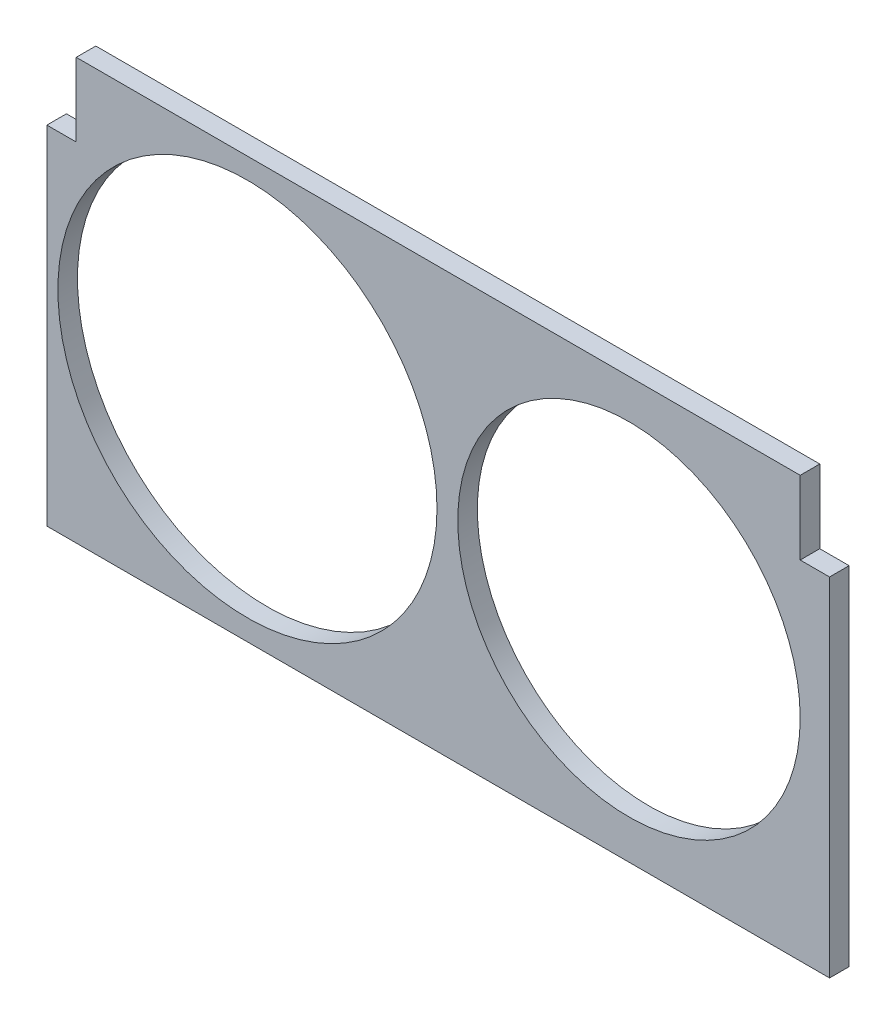
ISO-10303-21;
HEADER;
FILE_DESCRIPTION(('STEP AP214'),'2;1');
FILE_NAME('part.step','',(''),(''),'','','');
FILE_SCHEMA(('AUTOMOTIVE_DESIGN { 1 0 10303 214 1 1 1 1 }'));
ENDSEC;
DATA;
#1=APPLICATION_CONTEXT('core data for automotive mechanical design processes');
#2=APPLICATION_PROTOCOL_DEFINITION('international standard','automotive_design',2000,#1);
#3=PRODUCT_CONTEXT('',#1,'mechanical');
#4=PRODUCT('Part','Part','',(#3));
#5=PRODUCT_RELATED_PRODUCT_CATEGORY('part','',(#4));
#6=PRODUCT_DEFINITION_FORMATION('','',#4);
#7=PRODUCT_DEFINITION_CONTEXT('part definition',#1,'design');
#8=PRODUCT_DEFINITION('design','',#6,#7);
#9=PRODUCT_DEFINITION_SHAPE('','',#8);
#10=(LENGTH_UNIT() NAMED_UNIT(*) SI_UNIT(.MILLI.,.METRE.));
#11=(NAMED_UNIT(*) PLANE_ANGLE_UNIT() SI_UNIT($,.RADIAN.));
#12=(NAMED_UNIT(*) SI_UNIT($,.STERADIAN.) SOLID_ANGLE_UNIT());
#13=UNCERTAINTY_MEASURE_WITH_UNIT(LENGTH_MEASURE(1.E-05),#10,'distance_accuracy_value','');
#14=(GEOMETRIC_REPRESENTATION_CONTEXT(3) GLOBAL_UNCERTAINTY_ASSIGNED_CONTEXT((#13)) GLOBAL_UNIT_ASSIGNED_CONTEXT((#10,
#11,#12)) REPRESENTATION_CONTEXT('',''));
#15=CARTESIAN_POINT('',(0.,0.,0.));
#16=DIRECTION('',(0.,0.,1.));
#17=DIRECTION('',(1.,0.,0.));
#18=AXIS2_PLACEMENT_3D('',#15,#16,#17);
#19=CARTESIAN_POINT('',(0.,0.,8.));
#20=DIRECTION('',(0.,0.,-1.));
#21=DIRECTION('',(-1.,0.,0.));
#22=AXIS2_PLACEMENT_3D('',#19,#20,#21);
#23=PLANE('',#22);
#24=DIRECTION('',(0.,-1.,0.));
#25=VECTOR('',#24,1.);
#26=CARTESIAN_POINT('',(-160.27028303853,-60.3544303797468,8.));
#27=LINE('',#26,#25);
#28=CARTESIAN_POINT('',(-160.27028303853,81.6455696202532,8.));
#29=VERTEX_POINT('',#28);
#30=CARTESIAN_POINT('',(-160.27028303853,-60.3544303797468,8.));
#31=VERTEX_POINT('',#30);
#32=EDGE_CURVE('E144',#29,#31,#27,.T.);
#33=ORIENTED_EDGE('',*,*,#32,.T.);
#34=DIRECTION('',(1.,0.,0.));
#35=VECTOR('',#34,1.);
#36=CARTESIAN_POINT('',(-160.27028303853,-60.3544303797468,8.));
#37=LINE('',#36,#35);
#38=CARTESIAN_POINT('',(159.72971696147,-60.3544303797468,8.));
#39=VERTEX_POINT('',#38);
#40=EDGE_CURVE('E92',#31,#39,#37,.T.);
#41=ORIENTED_EDGE('',*,*,#40,.T.);
#42=DIRECTION('',(0.,1.,0.));
#43=VECTOR('',#42,1.);
#44=CARTESIAN_POINT('',(159.72971696147,-60.3544303797468,8.));
#45=LINE('',#44,#43);
#46=CARTESIAN_POINT('',(159.72971696147,81.6455696202532,8.));
#47=VERTEX_POINT('',#46);
#48=EDGE_CURVE('E159',#39,#47,#45,.T.);
#49=ORIENTED_EDGE('',*,*,#48,.T.);
#50=DIRECTION('',(-1.,0.,0.));
#51=VECTOR('',#50,1.);
#52=CARTESIAN_POINT('',(159.72971696147,81.6455696202532,8.));
#53=LINE('',#52,#51);
#54=CARTESIAN_POINT('',(147.72971696147,81.6455696202532,8.));
#55=VERTEX_POINT('',#54);
#56=EDGE_CURVE('E172',#47,#55,#53,.T.);
#57=ORIENTED_EDGE('',*,*,#56,.T.);
#58=DIRECTION('',(0.,1.,0.));
#59=VECTOR('',#58,1.);
#60=CARTESIAN_POINT('',(147.72971696147,111.645569620253,8.));
#61=LINE('',#60,#59);
#62=CARTESIAN_POINT('',(147.72971696147,111.645569620253,8.));
#63=VERTEX_POINT('',#62);
#64=EDGE_CURVE('E111',#55,#63,#61,.T.);
#65=ORIENTED_EDGE('',*,*,#64,.T.);
#66=DIRECTION('',(-1.,0.,0.));
#67=VECTOR('',#66,1.);
#68=CARTESIAN_POINT('',(-148.27028303853,111.645569620253,8.));
#69=LINE('',#68,#67);
#70=CARTESIAN_POINT('',(-148.27028303853,111.645569620253,8.));
#71=VERTEX_POINT('',#70);
#72=EDGE_CURVE('E105',#63,#71,#69,.T.);
#73=ORIENTED_EDGE('',*,*,#72,.T.);
#74=DIRECTION('',(0.,-1.,0.));
#75=VECTOR('',#74,1.);
#76=CARTESIAN_POINT('',(-148.27028303853,111.645569620253,8.));
#77=LINE('',#76,#75);
#78=CARTESIAN_POINT('',(-148.27028303853,81.6455696202532,8.));
#79=VERTEX_POINT('',#78);
#80=EDGE_CURVE('E109',#71,#79,#77,.T.);
#81=ORIENTED_EDGE('',*,*,#80,.T.);
#82=DIRECTION('',(-1.,0.,0.));
#83=VECTOR('',#82,1.);
#84=CARTESIAN_POINT('',(-160.27028303853,81.6455696202532,8.));
#85=LINE('',#84,#83);
#86=EDGE_CURVE('E49',#79,#29,#85,.T.);
#87=ORIENTED_EDGE('',*,*,#86,.T.);
#88=EDGE_LOOP('',(#33,#41,#49,#57,#65,#73,#81,#87));
#89=FACE_BOUND('',#88,.T.);
#90=CARTESIAN_POINT('',(-78.2702830385304,25.6455696202532,8.));
#91=DIRECTION('',(0.,0.,1.));
#92=DIRECTION('',(1.,0.,0.));
#93=AXIS2_PLACEMENT_3D('',#90,#91,#92);
#94=CIRCLE('',#93,77.5);
#95=CARTESIAN_POINT('',(-0.770283038530398,25.6455696202532,8.));
#96=VERTEX_POINT('',#95);
#97=EDGE_CURVE('E133',#96,#96,#94,.T.);
#98=ORIENTED_EDGE('',*,*,#97,.F.);
#99=EDGE_LOOP('',(#98));
#100=FACE_BOUND('',#99,.T.);
#101=CARTESIAN_POINT('',(77.7297169614696,25.6455696202532,8.));
#102=DIRECTION('',(0.,0.,1.));
#103=DIRECTION('',(1.,0.,0.));
#104=AXIS2_PLACEMENT_3D('',#101,#102,#103);
#105=CIRCLE('',#104,70.);
#106=CARTESIAN_POINT('',(147.72971696147,25.6455696202532,8.));
#107=VERTEX_POINT('',#106);
#108=EDGE_CURVE('E181',#107,#107,#105,.T.);
#109=ORIENTED_EDGE('',*,*,#108,.F.);
#110=EDGE_LOOP('',(#109));
#111=FACE_BOUND('',#110,.T.);
#112=ADVANCED_FACE('F32',(#89,#100,#111),#23,.F.);
#113=CARTESIAN_POINT('',(0.,0.,0.));
#114=DIRECTION('',(0.,0.,-1.));
#115=DIRECTION('',(-1.,0.,0.));
#116=AXIS2_PLACEMENT_3D('',#113,#114,#115);
#117=PLANE('',#116);
#118=CARTESIAN_POINT('',(144.72971696147,-45.3544303797468,0.));
#119=DIRECTION('',(0.,0.,-1.));
#120=DIRECTION('',(-1.,0.,0.));
#121=AXIS2_PLACEMENT_3D('',#118,#119,#120);
#122=CIRCLE('',#121,1.5);
#123=CARTESIAN_POINT('',(143.22971696147,-45.3544303797468,0.));
#124=VERTEX_POINT('',#123);
#125=EDGE_CURVE('E202',#124,#124,#122,.T.);
#126=ORIENTED_EDGE('',*,*,#125,.F.);
#127=EDGE_LOOP('',(#126));
#128=FACE_BOUND('',#127,.T.);
#129=CARTESIAN_POINT('',(-145.27028303853,-45.3544303797468,0.));
#130=DIRECTION('',(0.,0.,-1.));
#131=DIRECTION('',(-1.,0.,0.));
#132=AXIS2_PLACEMENT_3D('',#129,#130,#131);
#133=CIRCLE('',#132,1.5);
#134=CARTESIAN_POINT('',(-146.77028303853,-45.3544303797468,0.));
#135=VERTEX_POINT('',#134);
#136=EDGE_CURVE('E196',#135,#135,#133,.T.);
#137=ORIENTED_EDGE('',*,*,#136,.F.);
#138=EDGE_LOOP('',(#137));
#139=FACE_BOUND('',#138,.T.);
#140=CARTESIAN_POINT('',(-0.270283038530314,96.6455696202532,0.));
#141=DIRECTION('',(0.,0.,-1.));
#142=DIRECTION('',(-1.,0.,0.));
#143=AXIS2_PLACEMENT_3D('',#140,#141,#142);
#144=CIRCLE('',#143,1.5);
#145=CARTESIAN_POINT('',(-1.77028303853031,96.6455696202532,0.));
#146=VERTEX_POINT('',#145);
#147=EDGE_CURVE('E190',#146,#146,#144,.T.);
#148=ORIENTED_EDGE('',*,*,#147,.F.);
#149=EDGE_LOOP('',(#148));
#150=FACE_BOUND('',#149,.T.);
#151=CARTESIAN_POINT('',(-78.2702830385304,25.6455696202532,0.));
#152=DIRECTION('',(0.,0.,1.));
#153=DIRECTION('',(1.,0.,0.));
#154=AXIS2_PLACEMENT_3D('',#151,#152,#153);
#155=CIRCLE('',#154,77.5);
#156=CARTESIAN_POINT('',(-0.770283038530398,25.6455696202532,0.));
#157=VERTEX_POINT('',#156);
#158=EDGE_CURVE('E178',#157,#157,#155,.T.);
#159=ORIENTED_EDGE('',*,*,#158,.T.);
#160=EDGE_LOOP('',(#159));
#161=FACE_BOUND('',#160,.T.);
#162=DIRECTION('',(0.,-1.,0.));
#163=VECTOR('',#162,1.);
#164=CARTESIAN_POINT('',(-160.27028303853,-60.3544303797468,0.));
#165=LINE('',#164,#163);
#166=CARTESIAN_POINT('',(-160.27028303853,81.6455696202532,0.));
#167=VERTEX_POINT('',#166);
#168=CARTESIAN_POINT('',(-160.27028303853,-60.3544303797468,0.));
#169=VERTEX_POINT('',#168);
#170=EDGE_CURVE('E129',#167,#169,#165,.T.);
#171=ORIENTED_EDGE('',*,*,#170,.F.);
#172=DIRECTION('',(-1.,0.,0.));
#173=VECTOR('',#172,1.);
#174=CARTESIAN_POINT('',(-160.27028303853,81.6455696202532,0.));
#175=LINE('',#174,#173);
#176=CARTESIAN_POINT('',(-148.27028303853,81.6455696202532,0.));
#177=VERTEX_POINT('',#176);
#178=EDGE_CURVE('E84',#177,#167,#175,.T.);
#179=ORIENTED_EDGE('',*,*,#178,.F.);
#180=DIRECTION('',(0.,-1.,0.));
#181=VECTOR('',#180,1.);
#182=CARTESIAN_POINT('',(-148.27028303853,111.645569620253,0.));
#183=LINE('',#182,#181);
#184=CARTESIAN_POINT('',(-148.27028303853,111.645569620253,0.));
#185=VERTEX_POINT('',#184);
#186=EDGE_CURVE('E78',#185,#177,#183,.T.);
#187=ORIENTED_EDGE('',*,*,#186,.F.);
#188=DIRECTION('',(-1.,0.,0.));
#189=VECTOR('',#188,1.);
#190=CARTESIAN_POINT('',(-148.27028303853,111.645569620253,0.));
#191=LINE('',#190,#189);
#192=CARTESIAN_POINT('',(147.72971696147,111.645569620253,0.));
#193=VERTEX_POINT('',#192);
#194=EDGE_CURVE('E119',#193,#185,#191,.T.);
#195=ORIENTED_EDGE('',*,*,#194,.F.);
#196=DIRECTION('',(0.,1.,0.));
#197=VECTOR('',#196,1.);
#198=CARTESIAN_POINT('',(147.72971696147,111.645569620253,0.));
#199=LINE('',#198,#197);
#200=CARTESIAN_POINT('',(147.72971696147,81.6455696202532,0.));
#201=VERTEX_POINT('',#200);
#202=EDGE_CURVE('E139',#201,#193,#199,.T.);
#203=ORIENTED_EDGE('',*,*,#202,.F.);
#204=DIRECTION('',(-1.,0.,0.));
#205=VECTOR('',#204,1.);
#206=CARTESIAN_POINT('',(159.72971696147,81.6455696202532,0.));
#207=LINE('',#206,#205);
#208=CARTESIAN_POINT('',(159.72971696147,81.6455696202532,0.));
#209=VERTEX_POINT('',#208);
#210=EDGE_CURVE('E137',#209,#201,#207,.T.);
#211=ORIENTED_EDGE('',*,*,#210,.F.);
#212=DIRECTION('',(0.,1.,0.));
#213=VECTOR('',#212,1.);
#214=CARTESIAN_POINT('',(159.72971696147,-60.3544303797468,0.));
#215=LINE('',#214,#213);
#216=CARTESIAN_POINT('',(159.72971696147,-60.3544303797468,0.));
#217=VERTEX_POINT('',#216);
#218=EDGE_CURVE('E135',#217,#209,#215,.T.);
#219=ORIENTED_EDGE('',*,*,#218,.F.);
#220=DIRECTION('',(1.,0.,0.));
#221=VECTOR('',#220,1.);
#222=CARTESIAN_POINT('',(-160.27028303853,-60.3544303797468,0.));
#223=LINE('',#222,#221);
#224=EDGE_CURVE('E132',#169,#217,#223,.T.);
#225=ORIENTED_EDGE('',*,*,#224,.F.);
#226=EDGE_LOOP('',(#171,#179,#187,#195,#203,#211,#219,#225));
#227=FACE_BOUND('',#226,.T.);
#228=CARTESIAN_POINT('',(77.7297169614696,25.6455696202532,0.));
#229=DIRECTION('',(0.,0.,1.));
#230=DIRECTION('',(1.,0.,0.));
#231=AXIS2_PLACEMENT_3D('',#228,#229,#230);
#232=CIRCLE('',#231,70.);
#233=CARTESIAN_POINT('',(147.72971696147,25.6455696202532,0.));
#234=VERTEX_POINT('',#233);
#235=EDGE_CURVE('E184',#234,#234,#232,.T.);
#236=ORIENTED_EDGE('',*,*,#235,.T.);
#237=EDGE_LOOP('',(#236));
#238=FACE_BOUND('',#237,.T.);
#239=ADVANCED_FACE('F163',(#128,#139,#150,#161,#227,#238),#117,.T.);
#240=CARTESIAN_POINT('',(-160.27028303853,-60.3544303797468,8.));
#241=DIRECTION('',(1.,0.,0.));
#242=DIRECTION('',(0.,1.,0.));
#243=AXIS2_PLACEMENT_3D('',#240,#241,#242);
#244=PLANE('',#243);
#245=ORIENTED_EDGE('',*,*,#170,.T.);
#246=DIRECTION('',(0.,0.,-1.));
#247=VECTOR('',#246,1.);
#248=CARTESIAN_POINT('',(-160.27028303853,-60.3544303797468,8.));
#249=LINE('',#248,#247);
#250=EDGE_CURVE('E11',#31,#169,#249,.T.);
#251=ORIENTED_EDGE('',*,*,#250,.F.);
#252=ORIENTED_EDGE('',*,*,#32,.F.);
#253=DIRECTION('',(0.,0.,-1.));
#254=VECTOR('',#253,1.);
#255=CARTESIAN_POINT('',(-160.27028303853,81.6455696202532,8.));
#256=LINE('',#255,#254);
#257=EDGE_CURVE('E125',#29,#167,#256,.T.);
#258=ORIENTED_EDGE('',*,*,#257,.T.);
#259=EDGE_LOOP('',(#245,#251,#252,#258));
#260=FACE_BOUND('',#259,.T.);
#261=ADVANCED_FACE('F34',(#260),#244,.F.);
#262=CARTESIAN_POINT('',(-160.27028303853,-60.3544303797468,8.));
#263=DIRECTION('',(0.,1.,0.));
#264=DIRECTION('',(0.,0.,1.));
#265=AXIS2_PLACEMENT_3D('',#262,#263,#264);
#266=PLANE('',#265);
#267=ORIENTED_EDGE('',*,*,#224,.T.);
#268=DIRECTION('',(0.,0.,-1.));
#269=VECTOR('',#268,1.);
#270=CARTESIAN_POINT('',(159.72971696147,-60.3544303797468,8.));
#271=LINE('',#270,#269);
#272=EDGE_CURVE('E41',#39,#217,#271,.T.);
#273=ORIENTED_EDGE('',*,*,#272,.F.);
#274=ORIENTED_EDGE('',*,*,#40,.F.);
#275=ORIENTED_EDGE('',*,*,#250,.T.);
#276=EDGE_LOOP('',(#267,#273,#274,#275));
#277=FACE_BOUND('',#276,.T.);
#278=ADVANCED_FACE('F254',(#277),#266,.F.);
#279=CARTESIAN_POINT('',(159.72971696147,-60.3544303797468,8.));
#280=DIRECTION('',(-1.,0.,0.));
#281=DIRECTION('',(0.,-1.,0.));
#282=AXIS2_PLACEMENT_3D('',#279,#280,#281);
#283=PLANE('',#282);
#284=ORIENTED_EDGE('',*,*,#218,.T.);
#285=DIRECTION('',(0.,0.,-1.));
#286=VECTOR('',#285,1.);
#287=CARTESIAN_POINT('',(159.72971696147,81.6455696202532,8.));
#288=LINE('',#287,#286);
#289=EDGE_CURVE('E151',#47,#209,#288,.T.);
#290=ORIENTED_EDGE('',*,*,#289,.F.);
#291=ORIENTED_EDGE('',*,*,#48,.F.);
#292=ORIENTED_EDGE('',*,*,#272,.T.);
#293=EDGE_LOOP('',(#284,#290,#291,#292));
#294=FACE_BOUND('',#293,.T.);
#295=ADVANCED_FACE('F157',(#294),#283,.F.);
#296=CARTESIAN_POINT('',(159.72971696147,81.6455696202532,8.));
#297=DIRECTION('',(0.,-1.,0.));
#298=DIRECTION('',(0.,0.,-1.));
#299=AXIS2_PLACEMENT_3D('',#296,#297,#298);
#300=PLANE('',#299);
#301=ORIENTED_EDGE('',*,*,#210,.T.);
#302=DIRECTION('',(0.,0.,-1.));
#303=VECTOR('',#302,1.);
#304=CARTESIAN_POINT('',(147.72971696147,81.6455696202532,8.));
#305=LINE('',#304,#303);
#306=EDGE_CURVE('E148',#55,#201,#305,.T.);
#307=ORIENTED_EDGE('',*,*,#306,.F.);
#308=ORIENTED_EDGE('',*,*,#56,.F.);
#309=ORIENTED_EDGE('',*,*,#289,.T.);
#310=EDGE_LOOP('',(#301,#307,#308,#309));
#311=FACE_BOUND('',#310,.T.);
#312=ADVANCED_FACE('F168',(#311),#300,.F.);
#313=CARTESIAN_POINT('',(147.72971696147,111.645569620253,8.));
#314=DIRECTION('',(-1.,0.,0.));
#315=DIRECTION('',(0.,-1.,0.));
#316=AXIS2_PLACEMENT_3D('',#313,#314,#315);
#317=PLANE('',#316);
#318=ORIENTED_EDGE('',*,*,#202,.T.);
#319=DIRECTION('',(0.,0.,-1.));
#320=VECTOR('',#319,1.);
#321=CARTESIAN_POINT('',(147.72971696147,111.645569620253,8.));
#322=LINE('',#321,#320);
#323=EDGE_CURVE('E120',#63,#193,#322,.T.);
#324=ORIENTED_EDGE('',*,*,#323,.F.);
#325=ORIENTED_EDGE('',*,*,#64,.F.);
#326=ORIENTED_EDGE('',*,*,#306,.T.);
#327=EDGE_LOOP('',(#318,#324,#325,#326));
#328=FACE_BOUND('',#327,.T.);
#329=ADVANCED_FACE('F171',(#328),#317,.F.);
#330=CARTESIAN_POINT('',(-148.27028303853,111.645569620253,8.));
#331=DIRECTION('',(0.,-1.,0.));
#332=DIRECTION('',(0.,0.,-1.));
#333=AXIS2_PLACEMENT_3D('',#330,#331,#332);
#334=PLANE('',#333);
#335=ORIENTED_EDGE('',*,*,#194,.T.);
#336=DIRECTION('',(0.,0.,-1.));
#337=VECTOR('',#336,1.);
#338=CARTESIAN_POINT('',(-148.27028303853,111.645569620253,8.));
#339=LINE('',#338,#337);
#340=EDGE_CURVE('E116',#71,#185,#339,.T.);
#341=ORIENTED_EDGE('',*,*,#340,.F.);
#342=ORIENTED_EDGE('',*,*,#72,.F.);
#343=ORIENTED_EDGE('',*,*,#323,.T.);
#344=EDGE_LOOP('',(#335,#341,#342,#343));
#345=FACE_BOUND('',#344,.T.);
#346=ADVANCED_FACE('F117',(#345),#334,.F.);
#347=CARTESIAN_POINT('',(-148.27028303853,111.645569620253,8.));
#348=DIRECTION('',(1.,0.,0.));
#349=DIRECTION('',(0.,1.,0.));
#350=AXIS2_PLACEMENT_3D('',#347,#348,#349);
#351=PLANE('',#350);
#352=ORIENTED_EDGE('',*,*,#186,.T.);
#353=DIRECTION('',(0.,0.,-1.));
#354=VECTOR('',#353,1.);
#355=CARTESIAN_POINT('',(-148.27028303853,81.6455696202532,8.));
#356=LINE('',#355,#354);
#357=EDGE_CURVE('E121',#79,#177,#356,.T.);
#358=ORIENTED_EDGE('',*,*,#357,.F.);
#359=ORIENTED_EDGE('',*,*,#80,.F.);
#360=ORIENTED_EDGE('',*,*,#340,.T.);
#361=EDGE_LOOP('',(#352,#358,#359,#360));
#362=FACE_BOUND('',#361,.T.);
#363=ADVANCED_FACE('F123',(#362),#351,.F.);
#364=CARTESIAN_POINT('',(-160.27028303853,81.6455696202532,8.));
#365=DIRECTION('',(0.,-1.,0.));
#366=DIRECTION('',(0.,0.,-1.));
#367=AXIS2_PLACEMENT_3D('',#364,#365,#366);
#368=PLANE('',#367);
#369=ORIENTED_EDGE('',*,*,#178,.T.);
#370=ORIENTED_EDGE('',*,*,#257,.F.);
#371=ORIENTED_EDGE('',*,*,#86,.F.);
#372=ORIENTED_EDGE('',*,*,#357,.T.);
#373=EDGE_LOOP('',(#369,#370,#371,#372));
#374=FACE_BOUND('',#373,.T.);
#375=ADVANCED_FACE('F229',(#374),#368,.F.);
#376=CARTESIAN_POINT('',(-78.2702830385304,25.6455696202532,8.));
#377=DIRECTION('',(0.,0.,-1.));
#378=DIRECTION('',(-1.,0.,0.));
#379=AXIS2_PLACEMENT_3D('',#376,#377,#378);
#380=CYLINDRICAL_SURFACE('',#379,77.5);
#381=ORIENTED_EDGE('',*,*,#97,.T.);
#382=EDGE_LOOP('',(#381));
#383=FACE_BOUND('',#382,.T.);
#384=ORIENTED_EDGE('',*,*,#158,.F.);
#385=EDGE_LOOP('',(#384));
#386=FACE_BOUND('',#385,.T.);
#387=ADVANCED_FACE('F226',(#383,#386),#380,.F.);
#388=CARTESIAN_POINT('',(77.7297169614696,25.6455696202532,8.));
#389=DIRECTION('',(0.,0.,-1.));
#390=DIRECTION('',(-1.,0.,0.));
#391=AXIS2_PLACEMENT_3D('',#388,#389,#390);
#392=CYLINDRICAL_SURFACE('',#391,70.);
#393=ORIENTED_EDGE('',*,*,#108,.T.);
#394=EDGE_LOOP('',(#393));
#395=FACE_BOUND('',#394,.T.);
#396=ORIENTED_EDGE('',*,*,#235,.F.);
#397=EDGE_LOOP('',(#396));
#398=FACE_BOUND('',#397,.T.);
#399=ADVANCED_FACE('F228',(#395,#398),#392,.F.);
#400=CARTESIAN_POINT('',(-0.270283038530314,96.6455696202532,6.));
#401=DIRECTION('',(0.,0.,-1.));
#402=DIRECTION('',(-1.,0.,0.));
#403=AXIS2_PLACEMENT_3D('',#400,#401,#402);
#404=CYLINDRICAL_SURFACE('',#403,1.5);
#405=CARTESIAN_POINT('',(-0.270283038530314,96.6455696202532,6.));
#406=DIRECTION('',(0.,0.,-1.));
#407=DIRECTION('',(-1.,0.,0.));
#408=AXIS2_PLACEMENT_3D('',#405,#406,#407);
#409=CIRCLE('',#408,1.5);
#410=CARTESIAN_POINT('',(-1.77028303853031,96.6455696202532,6.));
#411=VERTEX_POINT('',#410);
#412=EDGE_CURVE('E187',#411,#411,#409,.T.);
#413=ORIENTED_EDGE('',*,*,#412,.F.);
#414=EDGE_LOOP('',(#413));
#415=FACE_BOUND('',#414,.T.);
#416=ORIENTED_EDGE('',*,*,#147,.T.);
#417=EDGE_LOOP('',(#416));
#418=FACE_BOUND('',#417,.T.);
#419=ADVANCED_FACE('F236',(#415,#418),#404,.F.);
#420=CARTESIAN_POINT('',(-0.270283038530314,96.6455696202532,6.));
#421=DIRECTION('',(0.,0.,-1.));
#422=DIRECTION('',(-1.,0.,0.));
#423=AXIS2_PLACEMENT_3D('',#420,#421,#422);
#424=PLANE('',#423);
#425=ORIENTED_EDGE('',*,*,#412,.T.);
#426=EDGE_LOOP('',(#425));
#427=FACE_BOUND('',#426,.T.);
#428=ADVANCED_FACE('F281',(#427),#424,.T.);
#429=CARTESIAN_POINT('',(-145.27028303853,-45.3544303797468,6.));
#430=DIRECTION('',(0.,0.,-1.));
#431=DIRECTION('',(-1.,0.,0.));
#432=AXIS2_PLACEMENT_3D('',#429,#430,#431);
#433=CYLINDRICAL_SURFACE('',#432,1.5);
#434=CARTESIAN_POINT('',(-145.27028303853,-45.3544303797468,6.));
#435=DIRECTION('',(0.,0.,-1.));
#436=DIRECTION('',(-1.,0.,0.));
#437=AXIS2_PLACEMENT_3D('',#434,#435,#436);
#438=CIRCLE('',#437,1.5);
#439=CARTESIAN_POINT('',(-146.77028303853,-45.3544303797468,6.));
#440=VERTEX_POINT('',#439);
#441=EDGE_CURVE('E199',#440,#440,#438,.T.);
#442=ORIENTED_EDGE('',*,*,#441,.F.);
#443=EDGE_LOOP('',(#442));
#444=FACE_BOUND('',#443,.T.);
#445=ORIENTED_EDGE('',*,*,#136,.T.);
#446=EDGE_LOOP('',(#445));
#447=FACE_BOUND('',#446,.T.);
#448=ADVANCED_FACE('F291',(#444,#447),#433,.F.);
#449=CARTESIAN_POINT('',(-145.27028303853,-45.3544303797468,6.));
#450=DIRECTION('',(0.,0.,-1.));
#451=DIRECTION('',(-1.,0.,0.));
#452=AXIS2_PLACEMENT_3D('',#449,#450,#451);
#453=PLANE('',#452);
#454=ORIENTED_EDGE('',*,*,#441,.T.);
#455=EDGE_LOOP('',(#454));
#456=FACE_BOUND('',#455,.T.);
#457=ADVANCED_FACE('F213',(#456),#453,.T.);
#458=CARTESIAN_POINT('',(144.72971696147,-45.3544303797468,6.));
#459=DIRECTION('',(0.,0.,-1.));
#460=DIRECTION('',(-1.,0.,0.));
#461=AXIS2_PLACEMENT_3D('',#458,#459,#460);
#462=CYLINDRICAL_SURFACE('',#461,1.5);
#463=CARTESIAN_POINT('',(144.72971696147,-45.3544303797468,6.));
#464=DIRECTION('',(0.,0.,-1.));
#465=DIRECTION('',(-1.,0.,0.));
#466=AXIS2_PLACEMENT_3D('',#463,#464,#465);
#467=CIRCLE('',#466,1.5);
#468=CARTESIAN_POINT('',(143.22971696147,-45.3544303797468,6.));
#469=VERTEX_POINT('',#468);
#470=EDGE_CURVE('E193',#469,#469,#467,.T.);
#471=ORIENTED_EDGE('',*,*,#470,.F.);
#472=EDGE_LOOP('',(#471));
#473=FACE_BOUND('',#472,.T.);
#474=ORIENTED_EDGE('',*,*,#125,.T.);
#475=EDGE_LOOP('',(#474));
#476=FACE_BOUND('',#475,.T.);
#477=ADVANCED_FACE('F210',(#473,#476),#462,.F.);
#478=CARTESIAN_POINT('',(144.72971696147,-45.3544303797468,6.));
#479=DIRECTION('',(0.,0.,-1.));
#480=DIRECTION('',(-1.,0.,0.));
#481=AXIS2_PLACEMENT_3D('',#478,#479,#480);
#482=PLANE('',#481);
#483=ORIENTED_EDGE('',*,*,#470,.T.);
#484=EDGE_LOOP('',(#483));
#485=FACE_BOUND('',#484,.T.);
#486=ADVANCED_FACE('F208',(#485),#482,.T.);
#487=CLOSED_SHELL('',(#112,#239,#261,#278,#295,#312,#329,#346,#363,#375,#387,#399,#419,#428,
#448,#457,#477,#486));
#488=MANIFOLD_SOLID_BREP('B2',#487);
#489=ADVANCED_BREP_SHAPE_REPRESENTATION('',(#18,#488),#14);
#490=SHAPE_DEFINITION_REPRESENTATION(#9,#489);
ENDSEC;
END-ISO-10303-21;
